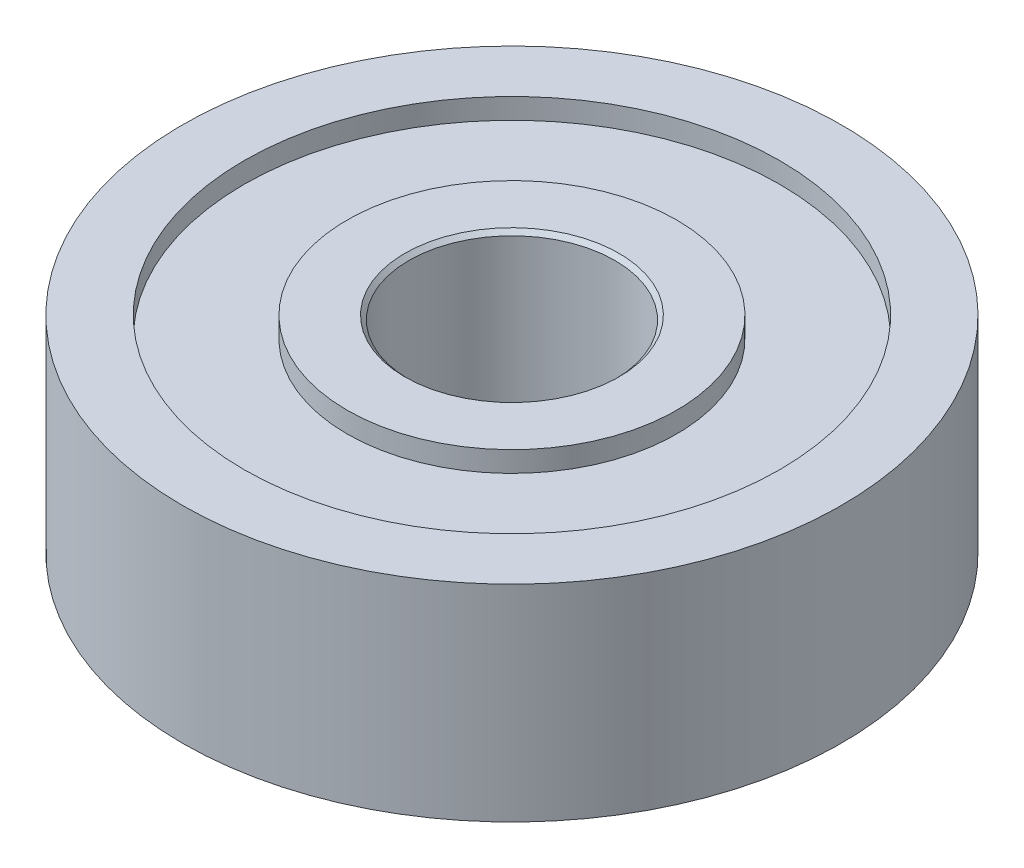
ISO-10303-21;
HEADER;
FILE_DESCRIPTION(('STEP AP214'),'2;1');
FILE_NAME('part.step','',(''),(''),'','','');
FILE_SCHEMA(('AUTOMOTIVE_DESIGN { 1 0 10303 214 1 1 1 1 }'));
ENDSEC;
DATA;
#1=APPLICATION_CONTEXT('core data for automotive mechanical design processes');
#2=APPLICATION_PROTOCOL_DEFINITION('international standard','automotive_design',2000,#1);
#3=PRODUCT_CONTEXT('',#1,'mechanical');
#4=PRODUCT('Part','Part','',(#3));
#5=PRODUCT_RELATED_PRODUCT_CATEGORY('part','',(#4));
#6=PRODUCT_DEFINITION_FORMATION('','',#4);
#7=PRODUCT_DEFINITION_CONTEXT('part definition',#1,'design');
#8=PRODUCT_DEFINITION('design','',#6,#7);
#9=PRODUCT_DEFINITION_SHAPE('','',#8);
#10=(LENGTH_UNIT() NAMED_UNIT(*) SI_UNIT(.MILLI.,.METRE.));
#11=(NAMED_UNIT(*) PLANE_ANGLE_UNIT() SI_UNIT($,.RADIAN.));
#12=(NAMED_UNIT(*) SI_UNIT($,.STERADIAN.) SOLID_ANGLE_UNIT());
#13=UNCERTAINTY_MEASURE_WITH_UNIT(LENGTH_MEASURE(1.E-05),#10,'distance_accuracy_value','');
#14=(GEOMETRIC_REPRESENTATION_CONTEXT(3) GLOBAL_UNCERTAINTY_ASSIGNED_CONTEXT((#13)) GLOBAL_UNIT_ASSIGNED_CONTEXT((#10,
#11,#12)) REPRESENTATION_CONTEXT('',''));
#15=CARTESIAN_POINT('',(0.,0.,0.));
#16=DIRECTION('',(0.,0.,1.));
#17=DIRECTION('',(1.,0.,0.));
#18=AXIS2_PLACEMENT_3D('',#15,#16,#17);
#19=CARTESIAN_POINT('',(0.,-2.5,0.));
#20=DIRECTION('',(0.,1.,0.));
#21=DIRECTION('',(0.,0.,1.));
#22=AXIS2_PLACEMENT_3D('',#19,#20,#21);
#23=PLANE('',#22);
#24=CARTESIAN_POINT('',(0.,-2.5,0.));
#25=DIRECTION('',(0.,1.,0.));
#26=DIRECTION('',(0.,0.,1.));
#27=AXIS2_PLACEMENT_3D('',#24,#25,#26);
#28=CIRCLE('',#27,2.6);
#29=CARTESIAN_POINT('',(0.,-2.5,2.6));
#30=VERTEX_POINT('',#29);
#31=EDGE_CURVE('E10',#30,#30,#28,.T.);
#32=ORIENTED_EDGE('',*,*,#31,.T.);
#33=EDGE_LOOP('',(#32));
#34=FACE_BOUND('',#33,.T.);
#35=CARTESIAN_POINT('',(0.,-2.5,0.));
#36=DIRECTION('',(0.,1.,0.));
#37=DIRECTION('',(0.,0.,1.));
#38=AXIS2_PLACEMENT_3D('',#35,#36,#37);
#39=CIRCLE('',#38,4.);
#40=CARTESIAN_POINT('',(0.,-2.5,4.));
#41=VERTEX_POINT('',#40);
#42=EDGE_CURVE('E96',#41,#41,#39,.T.);
#43=ORIENTED_EDGE('',*,*,#42,.F.);
#44=EDGE_LOOP('',(#43));
#45=FACE_BOUND('',#44,.T.);
#46=ADVANCED_FACE('F38',(#34,#45),#23,.F.);
#47=CARTESIAN_POINT('',(0.,2.5,0.));
#48=DIRECTION('',(0.,1.,0.));
#49=DIRECTION('',(0.,0.,1.));
#50=AXIS2_PLACEMENT_3D('',#47,#48,#49);
#51=PLANE('',#50);
#52=CARTESIAN_POINT('',(0.,2.5,0.));
#53=DIRECTION('',(0.,1.,0.));
#54=DIRECTION('',(0.,0.,1.));
#55=AXIS2_PLACEMENT_3D('',#52,#53,#54);
#56=CIRCLE('',#55,2.6);
#57=CARTESIAN_POINT('',(0.,2.5,2.6));
#58=VERTEX_POINT('',#57);
#59=EDGE_CURVE('E47',#58,#58,#56,.F.);
#60=ORIENTED_EDGE('',*,*,#59,.T.);
#61=EDGE_LOOP('',(#60));
#62=FACE_BOUND('',#61,.T.);
#63=CARTESIAN_POINT('',(0.,2.5,0.));
#64=DIRECTION('',(0.,1.,0.));
#65=DIRECTION('',(0.,0.,1.));
#66=AXIS2_PLACEMENT_3D('',#63,#64,#65);
#67=CIRCLE('',#66,4.);
#68=CARTESIAN_POINT('',(0.,2.5,4.));
#69=VERTEX_POINT('',#68);
#70=EDGE_CURVE('E80',#69,#69,#67,.T.);
#71=ORIENTED_EDGE('',*,*,#70,.T.);
#72=EDGE_LOOP('',(#71));
#73=FACE_BOUND('',#72,.T.);
#74=ADVANCED_FACE('F115',(#62,#73),#51,.T.);
#75=CARTESIAN_POINT('',(0.,2.5,0.));
#76=DIRECTION('',(0.,1.,0.));
#77=DIRECTION('',(0.,0.,1.));
#78=AXIS2_PLACEMENT_3D('',#75,#76,#77);
#79=CIRCLE('',#78,6.5);
#80=CARTESIAN_POINT('',(0.,2.5,6.5));
#81=VERTEX_POINT('',#80);
#82=EDGE_CURVE('E72',#81,#81,#79,.T.);
#83=ORIENTED_EDGE('',*,*,#82,.F.);
#84=EDGE_LOOP('',(#83));
#85=FACE_BOUND('',#84,.T.);
#86=CARTESIAN_POINT('',(0.,2.5,0.));
#87=DIRECTION('',(0.,1.,0.));
#88=DIRECTION('',(0.,0.,1.));
#89=AXIS2_PLACEMENT_3D('',#86,#87,#88);
#90=CIRCLE('',#89,8.);
#91=CARTESIAN_POINT('',(0.,2.5,8.));
#92=VERTEX_POINT('',#91);
#93=EDGE_CURVE('E63',#92,#92,#90,.T.);
#94=ORIENTED_EDGE('',*,*,#93,.T.);
#95=EDGE_LOOP('',(#94));
#96=FACE_BOUND('',#95,.T.);
#97=ADVANCED_FACE('F121',(#85,#96),#51,.T.);
#98=CARTESIAN_POINT('',(0.,-2.5,0.));
#99=DIRECTION('',(0.,1.,0.));
#100=DIRECTION('',(0.,0.,1.));
#101=AXIS2_PLACEMENT_3D('',#98,#99,#100);
#102=CIRCLE('',#101,6.5);
#103=CARTESIAN_POINT('',(0.,-2.5,6.5));
#104=VERTEX_POINT('',#103);
#105=EDGE_CURVE('E88',#104,#104,#102,.T.);
#106=ORIENTED_EDGE('',*,*,#105,.T.);
#107=EDGE_LOOP('',(#106));
#108=FACE_BOUND('',#107,.T.);
#109=CARTESIAN_POINT('',(0.,-2.5,0.));
#110=DIRECTION('',(0.,1.,0.));
#111=DIRECTION('',(0.,0.,1.));
#112=AXIS2_PLACEMENT_3D('',#109,#110,#111);
#113=CIRCLE('',#112,8.);
#114=CARTESIAN_POINT('',(0.,-2.5,8.));
#115=VERTEX_POINT('',#114);
#116=EDGE_CURVE('E64',#115,#115,#113,.T.);
#117=ORIENTED_EDGE('',*,*,#116,.F.);
#118=EDGE_LOOP('',(#117));
#119=FACE_BOUND('',#118,.T.);
#120=ADVANCED_FACE('F117',(#108,#119),#23,.F.);
#121=CARTESIAN_POINT('',(0.,2.5,0.));
#122=DIRECTION('',(0.,-1.,0.));
#123=DIRECTION('',(0.,0.,-1.));
#124=AXIS2_PLACEMENT_3D('',#121,#122,#123);
#125=CYLINDRICAL_SURFACE('',#124,8.);
#126=ORIENTED_EDGE('',*,*,#93,.F.);
#127=EDGE_LOOP('',(#126));
#128=FACE_BOUND('',#127,.T.);
#129=ORIENTED_EDGE('',*,*,#116,.T.);
#130=EDGE_LOOP('',(#129));
#131=FACE_BOUND('',#130,.T.);
#132=ADVANCED_FACE('F125',(#128,#131),#125,.T.);
#133=CARTESIAN_POINT('',(0.,2.5,0.));
#134=DIRECTION('',(0.,-1.,0.));
#135=DIRECTION('',(0.,0.,-1.));
#136=AXIS2_PLACEMENT_3D('',#133,#134,#135);
#137=CYLINDRICAL_SURFACE('',#136,2.5);
#138=CARTESIAN_POINT('',(0.,2.4,0.));
#139=DIRECTION('',(0.,1.,0.));
#140=DIRECTION('',(0.,0.,1.));
#141=AXIS2_PLACEMENT_3D('',#138,#139,#140);
#142=CIRCLE('',#141,2.5);
#143=CARTESIAN_POINT('',(0.,2.4,2.5));
#144=VERTEX_POINT('',#143);
#145=EDGE_CURVE('E52',#144,#144,#142,.T.);
#146=ORIENTED_EDGE('',*,*,#145,.T.);
#147=EDGE_LOOP('',(#146));
#148=FACE_BOUND('',#147,.T.);
#149=CARTESIAN_POINT('',(0.,-2.4,0.));
#150=DIRECTION('',(0.,1.,0.));
#151=DIRECTION('',(0.,0.,1.));
#152=AXIS2_PLACEMENT_3D('',#149,#150,#151);
#153=CIRCLE('',#152,2.5);
#154=CARTESIAN_POINT('',(0.,-2.4,2.5));
#155=VERTEX_POINT('',#154);
#156=EDGE_CURVE('E57',#155,#155,#153,.F.);
#157=ORIENTED_EDGE('',*,*,#156,.T.);
#158=EDGE_LOOP('',(#157));
#159=FACE_BOUND('',#158,.T.);
#160=ADVANCED_FACE('F131',(#148,#159),#137,.F.);
#161=CARTESIAN_POINT('',(0.,2.,0.));
#162=DIRECTION('',(0.,1.,0.));
#163=DIRECTION('',(0.,0.,1.));
#164=AXIS2_PLACEMENT_3D('',#161,#162,#163);
#165=CYLINDRICAL_SURFACE('',#164,6.5);
#166=CARTESIAN_POINT('',(0.,2.,0.));
#167=DIRECTION('',(0.,1.,0.));
#168=DIRECTION('',(0.,0.,1.));
#169=AXIS2_PLACEMENT_3D('',#166,#167,#168);
#170=CIRCLE('',#169,6.5);
#171=CARTESIAN_POINT('',(0.,2.,6.5));
#172=VERTEX_POINT('',#171);
#173=EDGE_CURVE('E68',#172,#172,#170,.T.);
#174=ORIENTED_EDGE('',*,*,#173,.F.);
#175=EDGE_LOOP('',(#174));
#176=FACE_BOUND('',#175,.T.);
#177=ORIENTED_EDGE('',*,*,#82,.T.);
#178=EDGE_LOOP('',(#177));
#179=FACE_BOUND('',#178,.T.);
#180=ADVANCED_FACE('F155',(#176,#179),#165,.F.);
#181=CARTESIAN_POINT('',(0.,2.,0.));
#182=DIRECTION('',(0.,1.,0.));
#183=DIRECTION('',(0.,0.,1.));
#184=AXIS2_PLACEMENT_3D('',#181,#182,#183);
#185=PLANE('',#184);
#186=CARTESIAN_POINT('',(0.,2.,0.));
#187=DIRECTION('',(0.,1.,0.));
#188=DIRECTION('',(0.,0.,1.));
#189=AXIS2_PLACEMENT_3D('',#186,#187,#188);
#190=CIRCLE('',#189,4.);
#191=CARTESIAN_POINT('',(0.,2.,4.));
#192=VERTEX_POINT('',#191);
#193=EDGE_CURVE('E76',#192,#192,#190,.T.);
#194=ORIENTED_EDGE('',*,*,#193,.F.);
#195=EDGE_LOOP('',(#194));
#196=FACE_BOUND('',#195,.T.);
#197=ORIENTED_EDGE('',*,*,#173,.T.);
#198=EDGE_LOOP('',(#197));
#199=FACE_BOUND('',#198,.T.);
#200=ADVANCED_FACE('F151',(#196,#199),#185,.T.);
#201=CARTESIAN_POINT('',(0.,2.,0.));
#202=DIRECTION('',(0.,1.,0.));
#203=DIRECTION('',(0.,0.,1.));
#204=AXIS2_PLACEMENT_3D('',#201,#202,#203);
#205=CYLINDRICAL_SURFACE('',#204,4.);
#206=ORIENTED_EDGE('',*,*,#193,.T.);
#207=EDGE_LOOP('',(#206));
#208=FACE_BOUND('',#207,.T.);
#209=ORIENTED_EDGE('',*,*,#70,.F.);
#210=EDGE_LOOP('',(#209));
#211=FACE_BOUND('',#210,.T.);
#212=ADVANCED_FACE('F145',(#208,#211),#205,.T.);
#213=CARTESIAN_POINT('',(0.,-2.,0.));
#214=DIRECTION('',(0.,-1.,0.));
#215=DIRECTION('',(0.,0.,1.));
#216=AXIS2_PLACEMENT_3D('',#213,#214,#215);
#217=PLANE('',#216);
#218=CARTESIAN_POINT('',(0.,-2.,0.));
#219=DIRECTION('',(0.,1.,0.));
#220=DIRECTION('',(0.,0.,1.));
#221=AXIS2_PLACEMENT_3D('',#218,#219,#220);
#222=CIRCLE('',#221,6.5);
#223=CARTESIAN_POINT('',(0.,-2.,6.5));
#224=VERTEX_POINT('',#223);
#225=EDGE_CURVE('E84',#224,#224,#222,.T.);
#226=ORIENTED_EDGE('',*,*,#225,.F.);
#227=EDGE_LOOP('',(#226));
#228=FACE_BOUND('',#227,.T.);
#229=CARTESIAN_POINT('',(0.,-2.,0.));
#230=DIRECTION('',(0.,1.,0.));
#231=DIRECTION('',(0.,0.,1.));
#232=AXIS2_PLACEMENT_3D('',#229,#230,#231);
#233=CIRCLE('',#232,4.);
#234=CARTESIAN_POINT('',(0.,-2.,4.));
#235=VERTEX_POINT('',#234);
#236=EDGE_CURVE('E92',#235,#235,#233,.T.);
#237=ORIENTED_EDGE('',*,*,#236,.T.);
#238=EDGE_LOOP('',(#237));
#239=FACE_BOUND('',#238,.T.);
#240=ADVANCED_FACE('F104',(#228,#239),#217,.T.);
#241=CARTESIAN_POINT('',(0.,-2.,0.));
#242=DIRECTION('',(0.,-1.,0.));
#243=DIRECTION('',(0.,0.,-1.));
#244=AXIS2_PLACEMENT_3D('',#241,#242,#243);
#245=CYLINDRICAL_SURFACE('',#244,6.5);
#246=ORIENTED_EDGE('',*,*,#225,.T.);
#247=EDGE_LOOP('',(#246));
#248=FACE_BOUND('',#247,.T.);
#249=ORIENTED_EDGE('',*,*,#105,.F.);
#250=EDGE_LOOP('',(#249));
#251=FACE_BOUND('',#250,.T.);
#252=ADVANCED_FACE('F110',(#248,#251),#245,.F.);
#253=CARTESIAN_POINT('',(0.,-2.,0.));
#254=DIRECTION('',(0.,-1.,0.));
#255=DIRECTION('',(0.,0.,-1.));
#256=AXIS2_PLACEMENT_3D('',#253,#254,#255);
#257=CYLINDRICAL_SURFACE('',#256,4.);
#258=ORIENTED_EDGE('',*,*,#236,.F.);
#259=EDGE_LOOP('',(#258));
#260=FACE_BOUND('',#259,.T.);
#261=ORIENTED_EDGE('',*,*,#42,.T.);
#262=EDGE_LOOP('',(#261));
#263=FACE_BOUND('',#262,.T.);
#264=ADVANCED_FACE('F106',(#260,#263),#257,.T.);
#265=CARTESIAN_POINT('',(0.,2.4,0.));
#266=DIRECTION('',(0.,1.,0.));
#267=DIRECTION('',(0.,0.,1.));
#268=AXIS2_PLACEMENT_3D('',#265,#266,#267);
#269=CONICAL_SURFACE('',#268,2.5,0.78539816339745);
#270=ORIENTED_EDGE('',*,*,#59,.F.);
#271=EDGE_LOOP('',(#270));
#272=FACE_BOUND('',#271,.T.);
#273=ORIENTED_EDGE('',*,*,#145,.F.);
#274=EDGE_LOOP('',(#273));
#275=FACE_BOUND('',#274,.T.);
#276=ADVANCED_FACE('F109',(#272,#275),#269,.F.);
#277=CARTESIAN_POINT('',(0.,-2.5,0.));
#278=DIRECTION('',(0.,-1.,0.));
#279=DIRECTION('',(0.,0.,-1.));
#280=AXIS2_PLACEMENT_3D('',#277,#278,#279);
#281=CONICAL_SURFACE('',#280,2.6,0.785398163397455);
#282=ORIENTED_EDGE('',*,*,#156,.F.);
#283=EDGE_LOOP('',(#282));
#284=FACE_BOUND('',#283,.T.);
#285=ORIENTED_EDGE('',*,*,#31,.F.);
#286=EDGE_LOOP('',(#285));
#287=FACE_BOUND('',#286,.T.);
#288=ADVANCED_FACE('F41',(#284,#287),#281,.F.);
#289=CLOSED_SHELL('',(#46,#74,#97,#120,#132,#160,#180,#200,#212,#240,#252,#264,#276,#288));
#290=MANIFOLD_SOLID_BREP('B2',#289);
#291=ADVANCED_BREP_SHAPE_REPRESENTATION('',(#18,#290),#14);
#292=SHAPE_DEFINITION_REPRESENTATION(#9,#291);
ENDSEC;
END-ISO-10303-21;
